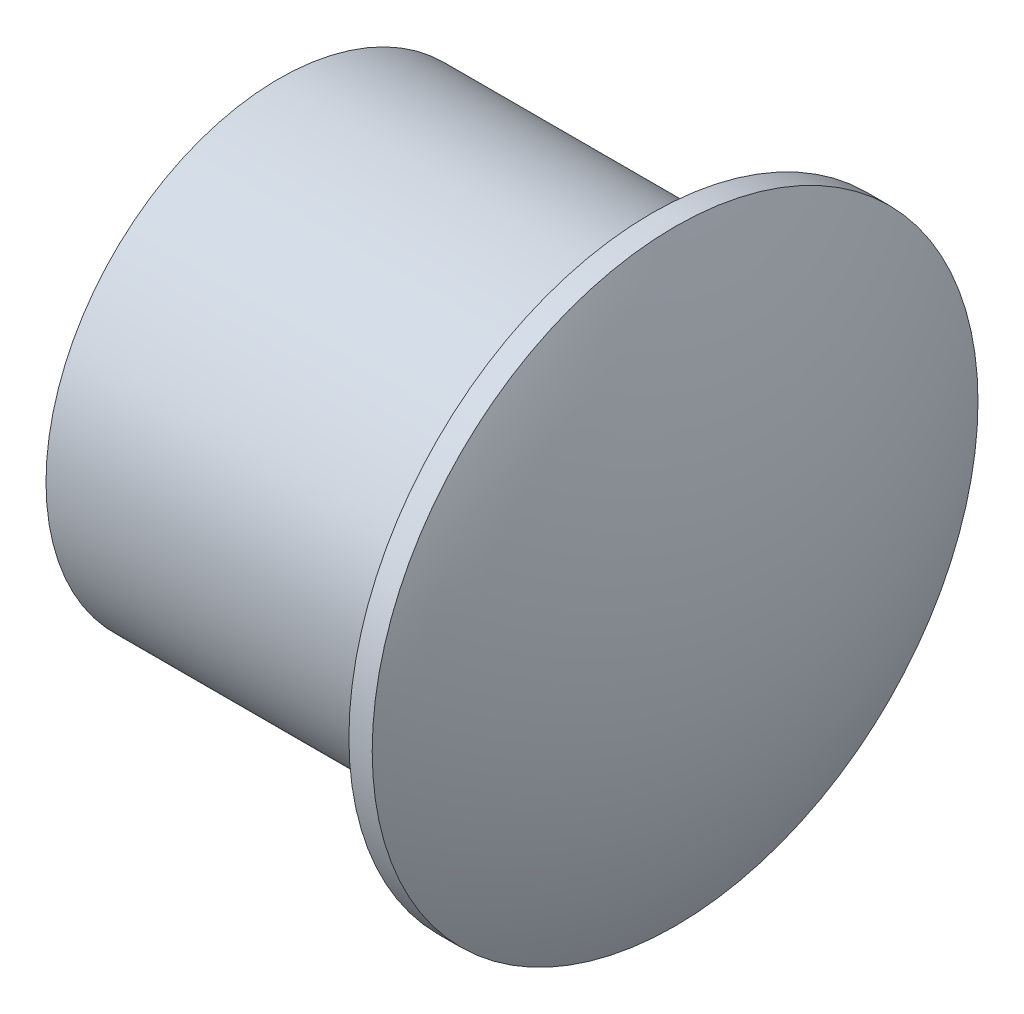
ISO-10303-21;
HEADER;
FILE_DESCRIPTION(('STEP AP214'),'2;1');
FILE_NAME('part.step','',(''),(''),'','','');
FILE_SCHEMA(('AUTOMOTIVE_DESIGN { 1 0 10303 214 1 1 1 1 }'));
ENDSEC;
DATA;
#1=APPLICATION_CONTEXT('core data for automotive mechanical design processes');
#2=APPLICATION_PROTOCOL_DEFINITION('international standard','automotive_design',2000,#1);
#3=PRODUCT_CONTEXT('',#1,'mechanical');
#4=PRODUCT('Part','Part','',(#3));
#5=PRODUCT_RELATED_PRODUCT_CATEGORY('part','',(#4));
#6=PRODUCT_DEFINITION_FORMATION('','',#4);
#7=PRODUCT_DEFINITION_CONTEXT('part definition',#1,'design');
#8=PRODUCT_DEFINITION('design','',#6,#7);
#9=PRODUCT_DEFINITION_SHAPE('','',#8);
#10=(LENGTH_UNIT() NAMED_UNIT(*) SI_UNIT(.MILLI.,.METRE.));
#11=(NAMED_UNIT(*) PLANE_ANGLE_UNIT() SI_UNIT($,.RADIAN.));
#12=(NAMED_UNIT(*) SI_UNIT($,.STERADIAN.) SOLID_ANGLE_UNIT());
#13=UNCERTAINTY_MEASURE_WITH_UNIT(LENGTH_MEASURE(1.E-05),#10,'distance_accuracy_value','');
#14=(GEOMETRIC_REPRESENTATION_CONTEXT(3) GLOBAL_UNCERTAINTY_ASSIGNED_CONTEXT((#13)) GLOBAL_UNIT_ASSIGNED_CONTEXT((#10,
#11,#12)) REPRESENTATION_CONTEXT('',''));
#15=CARTESIAN_POINT('',(0.,0.,0.));
#16=DIRECTION('',(0.,0.,1.));
#17=DIRECTION('',(1.,0.,0.));
#18=AXIS2_PLACEMENT_3D('',#15,#16,#17);
#19=CARTESIAN_POINT('',(-9.66666666666667,0.,0.));
#20=DIRECTION('',(-1.,0.,0.));
#21=DIRECTION('',(0.,1.,0.));
#22=AXIS2_PLACEMENT_3D('',#19,#20,#21);
#23=SPHERICAL_SURFACE('',#22,29.6666666666667);
#24=CARTESIAN_POINT('',(17.,0.,0.));
#25=DIRECTION('',(-1.,0.,0.));
#26=DIRECTION('',(0.,0.,1.));
#27=AXIS2_PLACEMENT_3D('',#24,#25,#26);
#28=CIRCLE('',#27,13.);
#29=CARTESIAN_POINT('',(17.,0.,13.));
#30=VERTEX_POINT('',#29);
#31=EDGE_CURVE('E10',#30,#30,#28,.T.);
#32=ORIENTED_EDGE('',*,*,#31,.F.);
#33=EDGE_LOOP('',(#32));
#34=FACE_BOUND('',#33,.T.);
#35=ADVANCED_FACE('F31',(#34),#23,.T.);
#36=CARTESIAN_POINT('',(0.,0.,0.));
#37=DIRECTION('',(-1.,0.,0.));
#38=DIRECTION('',(0.,0.,1.));
#39=AXIS2_PLACEMENT_3D('',#36,#37,#38);
#40=CYLINDRICAL_SURFACE('',#39,13.);
#41=CARTESIAN_POINT('',(16.,0.,0.));
#42=DIRECTION('',(-1.,0.,0.));
#43=DIRECTION('',(0.,0.,1.));
#44=AXIS2_PLACEMENT_3D('',#41,#42,#43);
#45=CIRCLE('',#44,13.);
#46=CARTESIAN_POINT('',(16.,0.,13.));
#47=VERTEX_POINT('',#46);
#48=EDGE_CURVE('E37',#47,#47,#45,.T.);
#49=ORIENTED_EDGE('',*,*,#48,.F.);
#50=EDGE_LOOP('',(#49));
#51=FACE_BOUND('',#50,.T.);
#52=ORIENTED_EDGE('',*,*,#31,.T.);
#53=EDGE_LOOP('',(#52));
#54=FACE_BOUND('',#53,.T.);
#55=ADVANCED_FACE('F61',(#51,#54),#40,.T.);
#56=CARTESIAN_POINT('',(16.,10.,0.));
#57=DIRECTION('',(1.,0.,0.));
#58=DIRECTION('',(0.,0.,-1.));
#59=AXIS2_PLACEMENT_3D('',#56,#57,#58);
#60=PLANE('',#59);
#61=CARTESIAN_POINT('',(16.,0.,0.));
#62=DIRECTION('',(-1.,0.,0.));
#63=DIRECTION('',(0.,0.,1.));
#64=AXIS2_PLACEMENT_3D('',#61,#62,#63);
#65=CIRCLE('',#64,10.);
#66=CARTESIAN_POINT('',(16.,0.,10.));
#67=VERTEX_POINT('',#66);
#68=EDGE_CURVE('E41',#67,#67,#65,.T.);
#69=ORIENTED_EDGE('',*,*,#68,.F.);
#70=EDGE_LOOP('',(#69));
#71=FACE_BOUND('',#70,.T.);
#72=ORIENTED_EDGE('',*,*,#48,.T.);
#73=EDGE_LOOP('',(#72));
#74=FACE_BOUND('',#73,.T.);
#75=ADVANCED_FACE('F56',(#71,#74),#60,.F.);
#76=CARTESIAN_POINT('',(0.,0.,0.));
#77=DIRECTION('',(-1.,0.,0.));
#78=DIRECTION('',(0.,0.,1.));
#79=AXIS2_PLACEMENT_3D('',#76,#77,#78);
#80=CYLINDRICAL_SURFACE('',#79,10.);
#81=CARTESIAN_POINT('',(0.,0.,0.));
#82=DIRECTION('',(-1.,0.,0.));
#83=DIRECTION('',(0.,0.,1.));
#84=AXIS2_PLACEMENT_3D('',#81,#82,#83);
#85=CIRCLE('',#84,10.);
#86=CARTESIAN_POINT('',(0.,0.,10.));
#87=VERTEX_POINT('',#86);
#88=EDGE_CURVE('E45',#87,#87,#85,.T.);
#89=ORIENTED_EDGE('',*,*,#88,.F.);
#90=EDGE_LOOP('',(#89));
#91=FACE_BOUND('',#90,.T.);
#92=ORIENTED_EDGE('',*,*,#68,.T.);
#93=EDGE_LOOP('',(#92));
#94=FACE_BOUND('',#93,.T.);
#95=ADVANCED_FACE('F53',(#91,#94),#80,.T.);
#96=CARTESIAN_POINT('',(0.,0.,0.));
#97=DIRECTION('',(1.,0.,0.));
#98=DIRECTION('',(0.,0.,-1.));
#99=AXIS2_PLACEMENT_3D('',#96,#97,#98);
#100=PLANE('',#99);
#101=ORIENTED_EDGE('',*,*,#88,.T.);
#102=EDGE_LOOP('',(#101));
#103=FACE_BOUND('',#102,.T.);
#104=ADVANCED_FACE('F51',(#103),#100,.F.);
#105=CLOSED_SHELL('',(#35,#55,#75,#95,#104));
#106=MANIFOLD_SOLID_BREP('B2',#105);
#107=ADVANCED_BREP_SHAPE_REPRESENTATION('',(#18,#106),#14);
#108=SHAPE_DEFINITION_REPRESENTATION(#9,#107);
ENDSEC;
END-ISO-10303-21;
